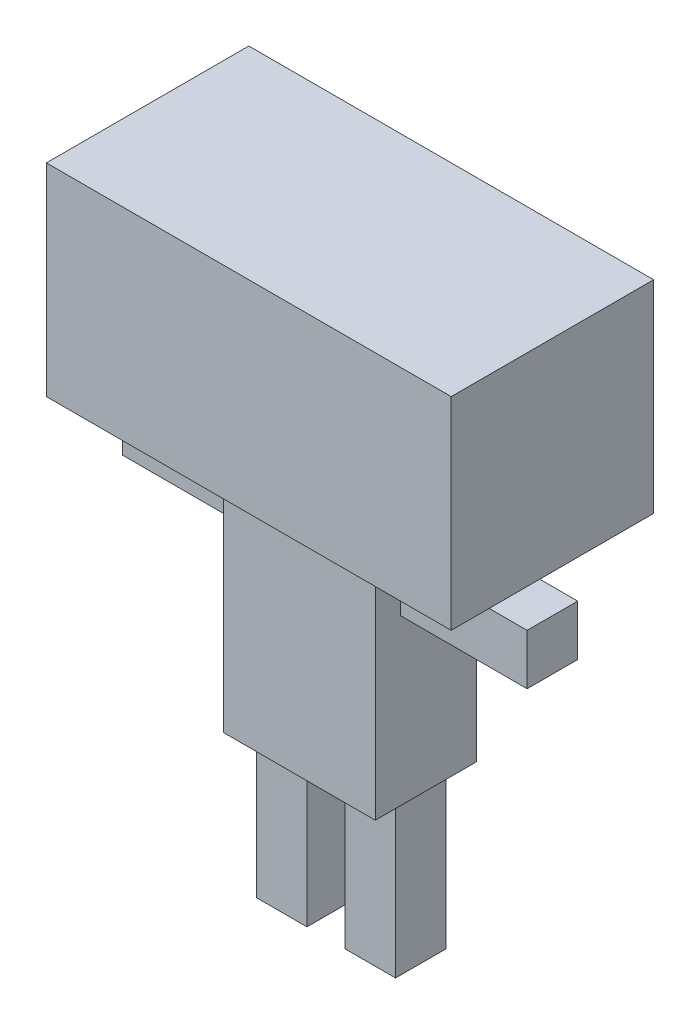
ISO-10303-21;
HEADER;
FILE_DESCRIPTION(('STEP AP214'),'2;1');
FILE_NAME('part.step','',(''),(''),'','','');
FILE_SCHEMA(('AUTOMOTIVE_DESIGN { 1 0 10303 214 1 1 1 1 }'));
ENDSEC;
DATA;
#1=APPLICATION_CONTEXT('core data for automotive mechanical design processes');
#2=APPLICATION_PROTOCOL_DEFINITION('international standard','automotive_design',2000,#1);
#3=PRODUCT_CONTEXT('',#1,'mechanical');
#4=PRODUCT('Part','Part','',(#3));
#5=PRODUCT_RELATED_PRODUCT_CATEGORY('part','',(#4));
#6=PRODUCT_DEFINITION_FORMATION('','',#4);
#7=PRODUCT_DEFINITION_CONTEXT('part definition',#1,'design');
#8=PRODUCT_DEFINITION('design','',#6,#7);
#9=PRODUCT_DEFINITION_SHAPE('','',#8);
#10=(LENGTH_UNIT() NAMED_UNIT(*) SI_UNIT(.MILLI.,.METRE.));
#11=(NAMED_UNIT(*) PLANE_ANGLE_UNIT() SI_UNIT($,.RADIAN.));
#12=(NAMED_UNIT(*) SI_UNIT($,.STERADIAN.) SOLID_ANGLE_UNIT());
#13=UNCERTAINTY_MEASURE_WITH_UNIT(LENGTH_MEASURE(1.E-05),#10,'distance_accuracy_value','');
#14=(GEOMETRIC_REPRESENTATION_CONTEXT(3) GLOBAL_UNCERTAINTY_ASSIGNED_CONTEXT((#13)) GLOBAL_UNIT_ASSIGNED_CONTEXT((#10,
#11,#12)) REPRESENTATION_CONTEXT('',''));
#15=CARTESIAN_POINT('',(0.,0.,0.));
#16=DIRECTION('',(0.,0.,1.));
#17=DIRECTION('',(1.,0.,0.));
#18=AXIS2_PLACEMENT_3D('',#15,#16,#17);
#19=CARTESIAN_POINT('',(0.,0.,-400.));
#20=DIRECTION('',(0.,0.,1.));
#21=DIRECTION('',(1.,0.,0.));
#22=AXIS2_PLACEMENT_3D('',#19,#20,#21);
#23=PLANE('',#22);
#24=CARTESIAN_POINT('',(-300.,1000.,-400.));
#25=DIRECTION('',(0.,0.,1.));
#26=DIRECTION('',(1.,0.,0.));
#27=AXIS2_PLACEMENT_3D('',#24,#25,#26);
#28=CIRCLE('',#27,100.);
#29=CARTESIAN_POINT('',(-200.,1000.,-400.));
#30=VERTEX_POINT('',#29);
#31=EDGE_CURVE('E11',#30,#30,#28,.F.);
#32=ORIENTED_EDGE('',*,*,#31,.F.);
#33=EDGE_LOOP('',(#32));
#34=FACE_BOUND('',#33,.T.);
#35=DIRECTION('',(0.,-1.,0.));
#36=VECTOR('',#35,1.);
#37=CARTESIAN_POINT('',(-800.,1300.,-400.));
#38=LINE('',#37,#36);
#39=CARTESIAN_POINT('',(-800.,1300.,-400.));
#40=VERTEX_POINT('',#39);
#41=CARTESIAN_POINT('',(-800.,500.,-400.));
#42=VERTEX_POINT('',#41);
#43=EDGE_CURVE('E410',#40,#42,#38,.T.);
#44=ORIENTED_EDGE('',*,*,#43,.F.);
#45=DIRECTION('',(-1.,0.,0.));
#46=VECTOR('',#45,1.);
#47=CARTESIAN_POINT('',(-800.,1300.,-400.));
#48=LINE('',#47,#46);
#49=CARTESIAN_POINT('',(800.,1300.,-400.));
#50=VERTEX_POINT('',#49);
#51=EDGE_CURVE('E419',#50,#40,#48,.T.);
#52=ORIENTED_EDGE('',*,*,#51,.F.);
#53=DIRECTION('',(0.,1.,0.));
#54=VECTOR('',#53,1.);
#55=CARTESIAN_POINT('',(800.,1300.,-400.));
#56=LINE('',#55,#54);
#57=CARTESIAN_POINT('',(800.,500.,-400.));
#58=VERTEX_POINT('',#57);
#59=EDGE_CURVE('E416',#58,#50,#56,.T.);
#60=ORIENTED_EDGE('',*,*,#59,.F.);
#61=DIRECTION('',(1.,0.,0.));
#62=VECTOR('',#61,1.);
#63=CARTESIAN_POINT('',(-800.,500.,-400.));
#64=LINE('',#63,#62);
#65=EDGE_CURVE('E413',#42,#58,#64,.T.);
#66=ORIENTED_EDGE('',*,*,#65,.F.);
#67=EDGE_LOOP('',(#44,#52,#60,#66));
#68=FACE_BOUND('',#67,.T.);
#69=CARTESIAN_POINT('',(300.,1000.,-400.));
#70=DIRECTION('',(0.,0.,1.));
#71=DIRECTION('',(1.,0.,0.));
#72=AXIS2_PLACEMENT_3D('',#69,#70,#71);
#73=CIRCLE('',#72,100.);
#74=CARTESIAN_POINT('',(400.,1000.,-400.));
#75=VERTEX_POINT('',#74);
#76=EDGE_CURVE('E41',#75,#75,#73,.F.);
#77=ORIENTED_EDGE('',*,*,#76,.F.);
#78=EDGE_LOOP('',(#77));
#79=FACE_BOUND('',#78,.T.);
#80=DIRECTION('',(0.707106781186547,0.707106781186547,0.));
#81=VECTOR('',#80,1.);
#82=CARTESIAN_POINT('',(-141.42135623731,658.578643762691,-400.));
#83=LINE('',#82,#81);
#84=CARTESIAN_POINT('',(-141.42135623731,658.578643762691,-400.));
#85=VERTEX_POINT('',#84);
#86=CARTESIAN_POINT('',(-1.11022302462516E-13,800.,-400.));
#87=VERTEX_POINT('',#86);
#88=EDGE_CURVE('E229',#85,#87,#83,.T.);
#89=ORIENTED_EDGE('',*,*,#88,.F.);
#90=DIRECTION('',(-1.,0.,0.));
#91=VECTOR('',#90,1.);
#92=CARTESIAN_POINT('',(141.421356237309,658.578643762691,-400.));
#93=LINE('',#92,#91);
#94=CARTESIAN_POINT('',(141.421356237309,658.578643762691,-400.));
#95=VERTEX_POINT('',#94);
#96=EDGE_CURVE('E52',#95,#85,#93,.T.);
#97=ORIENTED_EDGE('',*,*,#96,.F.);
#98=DIRECTION('',(0.707106781186548,-0.707106781186547,0.));
#99=VECTOR('',#98,1.);
#100=CARTESIAN_POINT('',(-1.11022302462516E-13,800.,-400.));
#101=LINE('',#100,#99);
#102=EDGE_CURVE('E48',#87,#95,#101,.T.);
#103=ORIENTED_EDGE('',*,*,#102,.F.);
#104=EDGE_LOOP('',(#89,#97,#103));
#105=FACE_BOUND('',#104,.T.);
#106=ADVANCED_FACE('F33',(#34,#68,#79,#105),#23,.F.);
#107=CARTESIAN_POINT('',(-300.,500.,-200.));
#108=DIRECTION('',(-1.,0.,0.));
#109=DIRECTION('',(0.,-1.,0.));
#110=AXIS2_PLACEMENT_3D('',#107,#108,#109);
#111=PLANE('',#110);
#112=DIRECTION('',(0.,0.,1.));
#113=VECTOR('',#112,1.);
#114=CARTESIAN_POINT('',(-300.,-500.,-200.));
#115=LINE('',#114,#113);
#116=CARTESIAN_POINT('',(-300.,-500.,-200.));
#117=VERTEX_POINT('',#116);
#118=CARTESIAN_POINT('',(-300.,-500.,200.));
#119=VERTEX_POINT('',#118);
#120=EDGE_CURVE('E389',#117,#119,#115,.T.);
#121=ORIENTED_EDGE('',*,*,#120,.T.);
#122=DIRECTION('',(0.,-1.,0.));
#123=VECTOR('',#122,1.);
#124=CARTESIAN_POINT('',(-300.,500.,200.));
#125=LINE('',#124,#123);
#126=CARTESIAN_POINT('',(-300.,500.,200.));
#127=VERTEX_POINT('',#126);
#128=EDGE_CURVE('E360',#127,#119,#125,.T.);
#129=ORIENTED_EDGE('',*,*,#128,.F.);
#130=DIRECTION('',(0.,0.,1.));
#131=VECTOR('',#130,1.);
#132=CARTESIAN_POINT('',(-300.,500.,-200.));
#133=LINE('',#132,#131);
#134=CARTESIAN_POINT('',(-300.,500.,-200.));
#135=VERTEX_POINT('',#134);
#136=EDGE_CURVE('E390',#135,#127,#133,.T.);
#137=ORIENTED_EDGE('',*,*,#136,.F.);
#138=DIRECTION('',(0.,-1.,0.));
#139=VECTOR('',#138,1.);
#140=CARTESIAN_POINT('',(-300.,500.,-200.));
#141=LINE('',#140,#139);
#142=EDGE_CURVE('E378',#135,#117,#141,.T.);
#143=ORIENTED_EDGE('',*,*,#142,.T.);
#144=EDGE_LOOP('',(#121,#129,#137,#143));
#145=FACE_BOUND('',#144,.T.);
#146=DIRECTION('',(0.,0.,1.));
#147=VECTOR('',#146,1.);
#148=CARTESIAN_POINT('',(-300.,150.,-100.));
#149=LINE('',#148,#147);
#150=CARTESIAN_POINT('',(-300.,150.,-100.));
#151=VERTEX_POINT('',#150);
#152=CARTESIAN_POINT('',(-300.,150.,100.));
#153=VERTEX_POINT('',#152);
#154=EDGE_CURVE('E287',#151,#153,#149,.T.);
#155=ORIENTED_EDGE('',*,*,#154,.F.);
#156=DIRECTION('',(0.,-1.,0.));
#157=VECTOR('',#156,1.);
#158=CARTESIAN_POINT('',(-300.,350.,-100.));
#159=LINE('',#158,#157);
#160=CARTESIAN_POINT('',(-300.,350.,-100.));
#161=VERTEX_POINT('',#160);
#162=EDGE_CURVE('E273',#161,#151,#159,.T.);
#163=ORIENTED_EDGE('',*,*,#162,.F.);
#164=DIRECTION('',(0.,0.,-1.));
#165=VECTOR('',#164,1.);
#166=CARTESIAN_POINT('',(-300.,350.,-100.));
#167=LINE('',#166,#165);
#168=CARTESIAN_POINT('',(-300.,350.,100.));
#169=VERTEX_POINT('',#168);
#170=EDGE_CURVE('E278',#169,#161,#167,.T.);
#171=ORIENTED_EDGE('',*,*,#170,.F.);
#172=DIRECTION('',(0.,1.,0.));
#173=VECTOR('',#172,1.);
#174=CARTESIAN_POINT('',(-300.,350.,100.));
#175=LINE('',#174,#173);
#176=EDGE_CURVE('E289',#153,#169,#175,.T.);
#177=ORIENTED_EDGE('',*,*,#176,.F.);
#178=EDGE_LOOP('',(#155,#163,#171,#177));
#179=FACE_BOUND('',#178,.T.);
#180=ADVANCED_FACE('F435',(#145,#179),#111,.T.);
#181=CARTESIAN_POINT('',(-300.,-500.,-200.));
#182=DIRECTION('',(0.,-1.,0.));
#183=DIRECTION('',(0.,0.,-1.));
#184=AXIS2_PLACEMENT_3D('',#181,#182,#183);
#185=PLANE('',#184);
#186=DIRECTION('',(0.,0.,1.));
#187=VECTOR('',#186,1.);
#188=CARTESIAN_POINT('',(-70.,-500.,-100.));
#189=LINE('',#188,#187);
#190=CARTESIAN_POINT('',(-70.,-500.,-100.));
#191=VERTEX_POINT('',#190);
#192=CARTESIAN_POINT('',(-69.9999999999999,-500.,100.));
#193=VERTEX_POINT('',#192);
#194=EDGE_CURVE('E361',#191,#193,#189,.T.);
#195=ORIENTED_EDGE('',*,*,#194,.F.);
#196=DIRECTION('',(-1.,0.,0.));
#197=VECTOR('',#196,1.);
#198=CARTESIAN_POINT('',(-270.,-500.,-100.));
#199=LINE('',#198,#197);
#200=CARTESIAN_POINT('',(-270.,-500.,-100.));
#201=VERTEX_POINT('',#200);
#202=EDGE_CURVE('E355',#191,#201,#199,.T.);
#203=ORIENTED_EDGE('',*,*,#202,.T.);
#204=DIRECTION('',(0.,0.,1.));
#205=VECTOR('',#204,1.);
#206=CARTESIAN_POINT('',(-270.,-500.,-100.));
#207=LINE('',#206,#205);
#208=CARTESIAN_POINT('',(-270.,-500.,100.));
#209=VERTEX_POINT('',#208);
#210=EDGE_CURVE('E358',#201,#209,#207,.T.);
#211=ORIENTED_EDGE('',*,*,#210,.T.);
#212=DIRECTION('',(-1.,0.,0.));
#213=VECTOR('',#212,1.);
#214=CARTESIAN_POINT('',(-270.,-500.,100.));
#215=LINE('',#214,#213);
#216=EDGE_CURVE('E343',#193,#209,#215,.T.);
#217=ORIENTED_EDGE('',*,*,#216,.F.);
#218=EDGE_LOOP('',(#195,#203,#211,#217));
#219=FACE_BOUND('',#218,.T.);
#220=DIRECTION('',(0.,0.,1.));
#221=VECTOR('',#220,1.);
#222=CARTESIAN_POINT('',(300.,-500.,-200.));
#223=LINE('',#222,#221);
#224=CARTESIAN_POINT('',(300.,-500.,-200.));
#225=VERTEX_POINT('',#224);
#226=CARTESIAN_POINT('',(300.,-500.,200.));
#227=VERTEX_POINT('',#226);
#228=EDGE_CURVE('E396',#225,#227,#223,.T.);
#229=ORIENTED_EDGE('',*,*,#228,.T.);
#230=DIRECTION('',(1.,0.,0.));
#231=VECTOR('',#230,1.);
#232=CARTESIAN_POINT('',(-300.,-500.,200.));
#233=LINE('',#232,#231);
#234=EDGE_CURVE('E369',#119,#227,#233,.T.);
#235=ORIENTED_EDGE('',*,*,#234,.F.);
#236=ORIENTED_EDGE('',*,*,#120,.F.);
#237=DIRECTION('',(1.,0.,0.));
#238=VECTOR('',#237,1.);
#239=CARTESIAN_POINT('',(-300.,-500.,-200.));
#240=LINE('',#239,#238);
#241=EDGE_CURVE('E381',#117,#225,#240,.T.);
#242=ORIENTED_EDGE('',*,*,#241,.T.);
#243=EDGE_LOOP('',(#229,#235,#236,#242));
#244=FACE_BOUND('',#243,.T.);
#245=DIRECTION('',(0.,0.,1.));
#246=VECTOR('',#245,1.);
#247=CARTESIAN_POINT('',(280.,-500.,-100.));
#248=LINE('',#247,#246);
#249=CARTESIAN_POINT('',(280.,-500.,-100.));
#250=VERTEX_POINT('',#249);
#251=CARTESIAN_POINT('',(280.,-500.,100.));
#252=VERTEX_POINT('',#251);
#253=EDGE_CURVE('E329',#250,#252,#248,.T.);
#254=ORIENTED_EDGE('',*,*,#253,.F.);
#255=DIRECTION('',(-1.,0.,0.));
#256=VECTOR('',#255,1.);
#257=CARTESIAN_POINT('',(80.,-500.,-100.));
#258=LINE('',#257,#256);
#259=CARTESIAN_POINT('',(80.,-500.,-100.));
#260=VERTEX_POINT('',#259);
#261=EDGE_CURVE('E323',#250,#260,#258,.T.);
#262=ORIENTED_EDGE('',*,*,#261,.T.);
#263=DIRECTION('',(0.,0.,1.));
#264=VECTOR('',#263,1.);
#265=CARTESIAN_POINT('',(80.,-500.,-100.));
#266=LINE('',#265,#264);
#267=CARTESIAN_POINT('',(80.,-500.,100.));
#268=VERTEX_POINT('',#267);
#269=EDGE_CURVE('E326',#260,#268,#266,.T.);
#270=ORIENTED_EDGE('',*,*,#269,.T.);
#271=DIRECTION('',(-1.,0.,0.));
#272=VECTOR('',#271,1.);
#273=CARTESIAN_POINT('',(80.,-500.,100.));
#274=LINE('',#273,#272);
#275=EDGE_CURVE('E311',#252,#268,#274,.T.);
#276=ORIENTED_EDGE('',*,*,#275,.F.);
#277=EDGE_LOOP('',(#254,#262,#270,#276));
#278=FACE_BOUND('',#277,.T.);
#279=ADVANCED_FACE('F563',(#219,#244,#278),#185,.T.);
#280=CARTESIAN_POINT('',(-800.,500.,-400.));
#281=DIRECTION('',(0.,-1.,0.));
#282=DIRECTION('',(0.,0.,-1.));
#283=AXIS2_PLACEMENT_3D('',#280,#281,#282);
#284=PLANE('',#283);
#285=DIRECTION('',(0.,0.,1.));
#286=VECTOR('',#285,1.);
#287=CARTESIAN_POINT('',(800.,500.,-400.));
#288=LINE('',#287,#286);
#289=CARTESIAN_POINT('',(800.,500.,400.));
#290=VERTEX_POINT('',#289);
#291=EDGE_CURVE('E427',#58,#290,#288,.T.);
#292=ORIENTED_EDGE('',*,*,#291,.T.);
#293=DIRECTION('',(1.,0.,0.));
#294=VECTOR('',#293,1.);
#295=CARTESIAN_POINT('',(-800.,500.,400.));
#296=LINE('',#295,#294);
#297=CARTESIAN_POINT('',(-800.,500.,400.));
#298=VERTEX_POINT('',#297);
#299=EDGE_CURVE('E401',#298,#290,#296,.T.);
#300=ORIENTED_EDGE('',*,*,#299,.F.);
#301=DIRECTION('',(0.,0.,1.));
#302=VECTOR('',#301,1.);
#303=CARTESIAN_POINT('',(-800.,500.,-400.));
#304=LINE('',#303,#302);
#305=EDGE_CURVE('E422',#42,#298,#304,.T.);
#306=ORIENTED_EDGE('',*,*,#305,.F.);
#307=ORIENTED_EDGE('',*,*,#65,.T.);
#308=EDGE_LOOP('',(#292,#300,#306,#307));
#309=FACE_BOUND('',#308,.T.);
#310=DIRECTION('',(0.,0.,1.));
#311=VECTOR('',#310,1.);
#312=CARTESIAN_POINT('',(300.,500.,-200.));
#313=LINE('',#312,#311);
#314=CARTESIAN_POINT('',(300.,500.,-200.));
#315=VERTEX_POINT('',#314);
#316=CARTESIAN_POINT('',(300.,500.,200.));
#317=VERTEX_POINT('',#316);
#318=EDGE_CURVE('E393',#315,#317,#313,.T.);
#319=ORIENTED_EDGE('',*,*,#318,.F.);
#320=DIRECTION('',(-1.,0.,0.));
#321=VECTOR('',#320,1.);
#322=CARTESIAN_POINT('',(-300.,500.,-200.));
#323=LINE('',#322,#321);
#324=EDGE_CURVE('E387',#315,#135,#323,.T.);
#325=ORIENTED_EDGE('',*,*,#324,.T.);
#326=ORIENTED_EDGE('',*,*,#136,.T.);
#327=DIRECTION('',(-1.,0.,0.));
#328=VECTOR('',#327,1.);
#329=CARTESIAN_POINT('',(-300.,500.,200.));
#330=LINE('',#329,#328);
#331=EDGE_CURVE('E375',#317,#127,#330,.T.);
#332=ORIENTED_EDGE('',*,*,#331,.F.);
#333=EDGE_LOOP('',(#319,#325,#326,#332));
#334=FACE_BOUND('',#333,.T.);
#335=ADVANCED_FACE('F566',(#309,#334),#284,.T.);
#336=CARTESIAN_POINT('',(-800.,1300.,-400.));
#337=DIRECTION('',(-1.,0.,0.));
#338=DIRECTION('',(0.,-1.,0.));
#339=AXIS2_PLACEMENT_3D('',#336,#337,#338);
#340=PLANE('',#339);
#341=ORIENTED_EDGE('',*,*,#305,.T.);
#342=DIRECTION('',(0.,-1.,0.));
#343=VECTOR('',#342,1.);
#344=CARTESIAN_POINT('',(-800.,1300.,400.));
#345=LINE('',#344,#343);
#346=CARTESIAN_POINT('',(-800.,1300.,400.));
#347=VERTEX_POINT('',#346);
#348=EDGE_CURVE('E392',#347,#298,#345,.T.);
#349=ORIENTED_EDGE('',*,*,#348,.F.);
#350=DIRECTION('',(0.,0.,1.));
#351=VECTOR('',#350,1.);
#352=CARTESIAN_POINT('',(-800.,1300.,-400.));
#353=LINE('',#352,#351);
#354=EDGE_CURVE('E423',#40,#347,#353,.T.);
#355=ORIENTED_EDGE('',*,*,#354,.F.);
#356=ORIENTED_EDGE('',*,*,#43,.T.);
#357=EDGE_LOOP('',(#341,#349,#355,#356));
#358=FACE_BOUND('',#357,.T.);
#359=ADVANCED_FACE('F35',(#358),#340,.T.);
#360=CARTESIAN_POINT('',(-800.,1300.,-400.));
#361=DIRECTION('',(0.,1.,0.));
#362=DIRECTION('',(0.,0.,1.));
#363=AXIS2_PLACEMENT_3D('',#360,#361,#362);
#364=PLANE('',#363);
#365=ORIENTED_EDGE('',*,*,#354,.T.);
#366=DIRECTION('',(-1.,0.,0.));
#367=VECTOR('',#366,1.);
#368=CARTESIAN_POINT('',(-800.,1300.,400.));
#369=LINE('',#368,#367);
#370=CARTESIAN_POINT('',(800.,1300.,400.));
#371=VERTEX_POINT('',#370);
#372=EDGE_CURVE('E407',#371,#347,#369,.T.);
#373=ORIENTED_EDGE('',*,*,#372,.F.);
#374=DIRECTION('',(0.,0.,1.));
#375=VECTOR('',#374,1.);
#376=CARTESIAN_POINT('',(800.,1300.,-400.));
#377=LINE('',#376,#375);
#378=EDGE_CURVE('E425',#50,#371,#377,.T.);
#379=ORIENTED_EDGE('',*,*,#378,.F.);
#380=ORIENTED_EDGE('',*,*,#51,.T.);
#381=EDGE_LOOP('',(#365,#373,#379,#380));
#382=FACE_BOUND('',#381,.T.);
#383=ADVANCED_FACE('F575',(#382),#364,.T.);
#384=CARTESIAN_POINT('',(800.,1300.,-400.));
#385=DIRECTION('',(1.,0.,0.));
#386=DIRECTION('',(0.,0.,-1.));
#387=AXIS2_PLACEMENT_3D('',#384,#385,#386);
#388=PLANE('',#387);
#389=ORIENTED_EDGE('',*,*,#378,.T.);
#390=DIRECTION('',(0.,1.,0.));
#391=VECTOR('',#390,1.);
#392=CARTESIAN_POINT('',(800.,1300.,400.));
#393=LINE('',#392,#391);
#394=EDGE_CURVE('E404',#290,#371,#393,.T.);
#395=ORIENTED_EDGE('',*,*,#394,.F.);
#396=ORIENTED_EDGE('',*,*,#291,.F.);
#397=ORIENTED_EDGE('',*,*,#59,.T.);
#398=EDGE_LOOP('',(#389,#395,#396,#397));
#399=FACE_BOUND('',#398,.T.);
#400=ADVANCED_FACE('F572',(#399),#388,.T.);
#401=CARTESIAN_POINT('',(0.,0.,400.));
#402=DIRECTION('',(0.,0.,1.));
#403=DIRECTION('',(1.,0.,0.));
#404=AXIS2_PLACEMENT_3D('',#401,#402,#403);
#405=PLANE('',#404);
#406=ORIENTED_EDGE('',*,*,#348,.T.);
#407=ORIENTED_EDGE('',*,*,#299,.T.);
#408=ORIENTED_EDGE('',*,*,#394,.T.);
#409=ORIENTED_EDGE('',*,*,#372,.T.);
#410=EDGE_LOOP('',(#406,#407,#408,#409));
#411=FACE_BOUND('',#410,.T.);
#412=ADVANCED_FACE('F561',(#411),#405,.T.);
#413=CARTESIAN_POINT('',(300.,500.,-200.));
#414=DIRECTION('',(1.,0.,0.));
#415=DIRECTION('',(0.,1.,0.));
#416=AXIS2_PLACEMENT_3D('',#413,#414,#415);
#417=PLANE('',#416);
#418=DIRECTION('',(0.,-1.,0.));
#419=VECTOR('',#418,1.);
#420=CARTESIAN_POINT('',(300.,350.,-100.));
#421=LINE('',#420,#419);
#422=CARTESIAN_POINT('',(300.,350.,-100.));
#423=VERTEX_POINT('',#422);
#424=CARTESIAN_POINT('',(300.,150.,-100.));
#425=VERTEX_POINT('',#424);
#426=EDGE_CURVE('E241',#423,#425,#421,.T.);
#427=ORIENTED_EDGE('',*,*,#426,.T.);
#428=DIRECTION('',(0.,0.,1.));
#429=VECTOR('',#428,1.);
#430=CARTESIAN_POINT('',(300.,150.,-100.));
#431=LINE('',#430,#429);
#432=CARTESIAN_POINT('',(300.,150.,100.));
#433=VERTEX_POINT('',#432);
#434=EDGE_CURVE('E246',#425,#433,#431,.T.);
#435=ORIENTED_EDGE('',*,*,#434,.T.);
#436=DIRECTION('',(0.,1.,0.));
#437=VECTOR('',#436,1.);
#438=CARTESIAN_POINT('',(300.,350.,100.));
#439=LINE('',#438,#437);
#440=CARTESIAN_POINT('',(300.,350.,100.));
#441=VERTEX_POINT('',#440);
#442=EDGE_CURVE('E259',#433,#441,#439,.T.);
#443=ORIENTED_EDGE('',*,*,#442,.T.);
#444=DIRECTION('',(0.,0.,-1.));
#445=VECTOR('',#444,1.);
#446=CARTESIAN_POINT('',(300.,350.,-100.));
#447=LINE('',#446,#445);
#448=EDGE_CURVE('E257',#441,#423,#447,.T.);
#449=ORIENTED_EDGE('',*,*,#448,.T.);
#450=EDGE_LOOP('',(#427,#435,#443,#449));
#451=FACE_BOUND('',#450,.T.);
#452=ORIENTED_EDGE('',*,*,#318,.T.);
#453=DIRECTION('',(0.,1.,0.));
#454=VECTOR('',#453,1.);
#455=CARTESIAN_POINT('',(300.,500.,200.));
#456=LINE('',#455,#454);
#457=EDGE_CURVE('E372',#227,#317,#456,.T.);
#458=ORIENTED_EDGE('',*,*,#457,.F.);
#459=ORIENTED_EDGE('',*,*,#228,.F.);
#460=DIRECTION('',(0.,1.,0.));
#461=VECTOR('',#460,1.);
#462=CARTESIAN_POINT('',(300.,500.,-200.));
#463=LINE('',#462,#461);
#464=EDGE_CURVE('E384',#225,#315,#463,.T.);
#465=ORIENTED_EDGE('',*,*,#464,.T.);
#466=EDGE_LOOP('',(#452,#458,#459,#465));
#467=FACE_BOUND('',#466,.T.);
#468=ADVANCED_FACE('F557',(#451,#467),#417,.T.);
#469=CARTESIAN_POINT('',(0.,0.,-200.));
#470=DIRECTION('',(0.,0.,1.));
#471=DIRECTION('',(1.,0.,0.));
#472=AXIS2_PLACEMENT_3D('',#469,#470,#471);
#473=PLANE('',#472);
#474=ORIENTED_EDGE('',*,*,#142,.F.);
#475=ORIENTED_EDGE('',*,*,#324,.F.);
#476=ORIENTED_EDGE('',*,*,#464,.F.);
#477=ORIENTED_EDGE('',*,*,#241,.F.);
#478=EDGE_LOOP('',(#474,#475,#476,#477));
#479=FACE_BOUND('',#478,.T.);
#480=ADVANCED_FACE('F553',(#479),#473,.F.);
#481=CARTESIAN_POINT('',(0.,0.,200.));
#482=DIRECTION('',(0.,0.,1.));
#483=DIRECTION('',(1.,0.,0.));
#484=AXIS2_PLACEMENT_3D('',#481,#482,#483);
#485=PLANE('',#484);
#486=ORIENTED_EDGE('',*,*,#128,.T.);
#487=ORIENTED_EDGE('',*,*,#234,.T.);
#488=ORIENTED_EDGE('',*,*,#457,.T.);
#489=ORIENTED_EDGE('',*,*,#331,.T.);
#490=EDGE_LOOP('',(#486,#487,#488,#489));
#491=FACE_BOUND('',#490,.T.);
#492=ADVANCED_FACE('F549',(#491),#485,.T.);
#493=CARTESIAN_POINT('',(-270.,-500.,-100.));
#494=DIRECTION('',(-1.,0.,0.));
#495=DIRECTION('',(0.,-1.,0.));
#496=AXIS2_PLACEMENT_3D('',#493,#494,#495);
#497=PLANE('',#496);
#498=DIRECTION('',(0.,0.,1.));
#499=VECTOR('',#498,1.);
#500=CARTESIAN_POINT('',(-270.,-1100.,-100.));
#501=LINE('',#500,#499);
#502=CARTESIAN_POINT('',(-270.,-1100.,-100.));
#503=VERTEX_POINT('',#502);
#504=CARTESIAN_POINT('',(-270.,-1100.,100.));
#505=VERTEX_POINT('',#504);
#506=EDGE_CURVE('E357',#503,#505,#501,.T.);
#507=ORIENTED_EDGE('',*,*,#506,.T.);
#508=DIRECTION('',(0.,-1.,0.));
#509=VECTOR('',#508,1.);
#510=CARTESIAN_POINT('',(-270.,-500.,100.));
#511=LINE('',#510,#509);
#512=EDGE_CURVE('E328',#209,#505,#511,.T.);
#513=ORIENTED_EDGE('',*,*,#512,.F.);
#514=ORIENTED_EDGE('',*,*,#210,.F.);
#515=DIRECTION('',(0.,-1.,0.));
#516=VECTOR('',#515,1.);
#517=CARTESIAN_POINT('',(-270.,-500.,-100.));
#518=LINE('',#517,#516);
#519=EDGE_CURVE('E346',#201,#503,#518,.T.);
#520=ORIENTED_EDGE('',*,*,#519,.T.);
#521=EDGE_LOOP('',(#507,#513,#514,#520));
#522=FACE_BOUND('',#521,.T.);
#523=ADVANCED_FACE('F542',(#522),#497,.T.);
#524=CARTESIAN_POINT('',(-70.,-500.,-100.));
#525=DIRECTION('',(1.,0.,0.));
#526=DIRECTION('',(0.,1.,0.));
#527=AXIS2_PLACEMENT_3D('',#524,#525,#526);
#528=PLANE('',#527);
#529=ORIENTED_EDGE('',*,*,#194,.T.);
#530=DIRECTION('',(0.,1.,0.));
#531=VECTOR('',#530,1.);
#532=CARTESIAN_POINT('',(-70.,-500.,100.));
#533=LINE('',#532,#531);
#534=CARTESIAN_POINT('',(-69.9999999999999,-1100.,100.));
#535=VERTEX_POINT('',#534);
#536=EDGE_CURVE('E340',#535,#193,#533,.T.);
#537=ORIENTED_EDGE('',*,*,#536,.F.);
#538=DIRECTION('',(0.,0.,1.));
#539=VECTOR('',#538,1.);
#540=CARTESIAN_POINT('',(-69.9999999999999,-1100.,-100.));
#541=LINE('',#540,#539);
#542=CARTESIAN_POINT('',(-69.9999999999999,-1100.,-100.));
#543=VERTEX_POINT('',#542);
#544=EDGE_CURVE('E364',#543,#535,#541,.T.);
#545=ORIENTED_EDGE('',*,*,#544,.F.);
#546=DIRECTION('',(0.,1.,0.));
#547=VECTOR('',#546,1.);
#548=CARTESIAN_POINT('',(-70.,-500.,-100.));
#549=LINE('',#548,#547);
#550=EDGE_CURVE('E352',#543,#191,#549,.T.);
#551=ORIENTED_EDGE('',*,*,#550,.T.);
#552=EDGE_LOOP('',(#529,#537,#545,#551));
#553=FACE_BOUND('',#552,.T.);
#554=ADVANCED_FACE('F539',(#553),#528,.T.);
#555=CARTESIAN_POINT('',(-270.,-1100.,-100.));
#556=DIRECTION('',(0.,-1.,0.));
#557=DIRECTION('',(0.,0.,-1.));
#558=AXIS2_PLACEMENT_3D('',#555,#556,#557);
#559=PLANE('',#558);
#560=ORIENTED_EDGE('',*,*,#544,.T.);
#561=DIRECTION('',(1.,0.,0.));
#562=VECTOR('',#561,1.);
#563=CARTESIAN_POINT('',(-270.,-1100.,100.));
#564=LINE('',#563,#562);
#565=EDGE_CURVE('E337',#505,#535,#564,.T.);
#566=ORIENTED_EDGE('',*,*,#565,.F.);
#567=ORIENTED_EDGE('',*,*,#506,.F.);
#568=DIRECTION('',(1.,0.,0.));
#569=VECTOR('',#568,1.);
#570=CARTESIAN_POINT('',(-270.,-1100.,-100.));
#571=LINE('',#570,#569);
#572=EDGE_CURVE('E349',#503,#543,#571,.T.);
#573=ORIENTED_EDGE('',*,*,#572,.T.);
#574=EDGE_LOOP('',(#560,#566,#567,#573));
#575=FACE_BOUND('',#574,.T.);
#576=ADVANCED_FACE('F537',(#575),#559,.T.);
#577=CARTESIAN_POINT('',(0.,0.,-100.));
#578=DIRECTION('',(0.,0.,1.));
#579=DIRECTION('',(1.,0.,0.));
#580=AXIS2_PLACEMENT_3D('',#577,#578,#579);
#581=PLANE('',#580);
#582=ORIENTED_EDGE('',*,*,#519,.F.);
#583=ORIENTED_EDGE('',*,*,#202,.F.);
#584=ORIENTED_EDGE('',*,*,#550,.F.);
#585=ORIENTED_EDGE('',*,*,#572,.F.);
#586=EDGE_LOOP('',(#582,#583,#584,#585));
#587=FACE_BOUND('',#586,.T.);
#588=ADVANCED_FACE('F533',(#587),#581,.F.);
#589=CARTESIAN_POINT('',(0.,0.,100.));
#590=DIRECTION('',(0.,0.,1.));
#591=DIRECTION('',(1.,0.,0.));
#592=AXIS2_PLACEMENT_3D('',#589,#590,#591);
#593=PLANE('',#592);
#594=ORIENTED_EDGE('',*,*,#512,.T.);
#595=ORIENTED_EDGE('',*,*,#565,.T.);
#596=ORIENTED_EDGE('',*,*,#536,.T.);
#597=ORIENTED_EDGE('',*,*,#216,.T.);
#598=EDGE_LOOP('',(#594,#595,#596,#597));
#599=FACE_BOUND('',#598,.T.);
#600=ADVANCED_FACE('F529',(#599),#593,.T.);
#601=CARTESIAN_POINT('',(80.,-500.,-100.));
#602=DIRECTION('',(-1.,0.,0.));
#603=DIRECTION('',(0.,-1.,0.));
#604=AXIS2_PLACEMENT_3D('',#601,#602,#603);
#605=PLANE('',#604);
#606=DIRECTION('',(0.,0.,1.));
#607=VECTOR('',#606,1.);
#608=CARTESIAN_POINT('',(80.0000000000001,-1100.,-100.));
#609=LINE('',#608,#607);
#610=CARTESIAN_POINT('',(80.0000000000001,-1100.,-100.));
#611=VERTEX_POINT('',#610);
#612=CARTESIAN_POINT('',(80.0000000000001,-1100.,100.));
#613=VERTEX_POINT('',#612);
#614=EDGE_CURVE('E325',#611,#613,#609,.T.);
#615=ORIENTED_EDGE('',*,*,#614,.T.);
#616=DIRECTION('',(0.,-1.,0.));
#617=VECTOR('',#616,1.);
#618=CARTESIAN_POINT('',(80.,-500.,100.));
#619=LINE('',#618,#617);
#620=EDGE_CURVE('E302',#268,#613,#619,.T.);
#621=ORIENTED_EDGE('',*,*,#620,.F.);
#622=ORIENTED_EDGE('',*,*,#269,.F.);
#623=DIRECTION('',(0.,-1.,0.));
#624=VECTOR('',#623,1.);
#625=CARTESIAN_POINT('',(80.,-500.,-100.));
#626=LINE('',#625,#624);
#627=EDGE_CURVE('E314',#260,#611,#626,.T.);
#628=ORIENTED_EDGE('',*,*,#627,.T.);
#629=EDGE_LOOP('',(#615,#621,#622,#628));
#630=FACE_BOUND('',#629,.T.);
#631=ADVANCED_FACE('F522',(#630),#605,.T.);
#632=CARTESIAN_POINT('',(280.,-500.,-100.));
#633=DIRECTION('',(1.,0.,0.));
#634=DIRECTION('',(0.,1.,0.));
#635=AXIS2_PLACEMENT_3D('',#632,#633,#634);
#636=PLANE('',#635);
#637=ORIENTED_EDGE('',*,*,#253,.T.);
#638=DIRECTION('',(0.,1.,0.));
#639=VECTOR('',#638,1.);
#640=CARTESIAN_POINT('',(280.,-500.,100.));
#641=LINE('',#640,#639);
#642=CARTESIAN_POINT('',(280.,-1100.,100.));
#643=VERTEX_POINT('',#642);
#644=EDGE_CURVE('E308',#643,#252,#641,.T.);
#645=ORIENTED_EDGE('',*,*,#644,.F.);
#646=DIRECTION('',(0.,0.,1.));
#647=VECTOR('',#646,1.);
#648=CARTESIAN_POINT('',(280.,-1100.,-100.));
#649=LINE('',#648,#647);
#650=CARTESIAN_POINT('',(280.,-1100.,-100.));
#651=VERTEX_POINT('',#650);
#652=EDGE_CURVE('E332',#651,#643,#649,.T.);
#653=ORIENTED_EDGE('',*,*,#652,.F.);
#654=DIRECTION('',(0.,1.,0.));
#655=VECTOR('',#654,1.);
#656=CARTESIAN_POINT('',(280.,-500.,-100.));
#657=LINE('',#656,#655);
#658=EDGE_CURVE('E320',#651,#250,#657,.T.);
#659=ORIENTED_EDGE('',*,*,#658,.T.);
#660=EDGE_LOOP('',(#637,#645,#653,#659));
#661=FACE_BOUND('',#660,.T.);
#662=ADVANCED_FACE('F519',(#661),#636,.T.);
#663=CARTESIAN_POINT('',(80.0000000000001,-1100.,-100.));
#664=DIRECTION('',(0.,-1.,0.));
#665=DIRECTION('',(0.,0.,-1.));
#666=AXIS2_PLACEMENT_3D('',#663,#664,#665);
#667=PLANE('',#666);
#668=ORIENTED_EDGE('',*,*,#652,.T.);
#669=DIRECTION('',(1.,0.,0.));
#670=VECTOR('',#669,1.);
#671=CARTESIAN_POINT('',(80.0000000000001,-1100.,100.));
#672=LINE('',#671,#670);
#673=EDGE_CURVE('E305',#613,#643,#672,.T.);
#674=ORIENTED_EDGE('',*,*,#673,.F.);
#675=ORIENTED_EDGE('',*,*,#614,.F.);
#676=DIRECTION('',(1.,0.,0.));
#677=VECTOR('',#676,1.);
#678=CARTESIAN_POINT('',(80.0000000000001,-1100.,-100.));
#679=LINE('',#678,#677);
#680=EDGE_CURVE('E317',#611,#651,#679,.T.);
#681=ORIENTED_EDGE('',*,*,#680,.T.);
#682=EDGE_LOOP('',(#668,#674,#675,#681));
#683=FACE_BOUND('',#682,.T.);
#684=ADVANCED_FACE('F517',(#683),#667,.T.);
#685=CARTESIAN_POINT('',(0.,0.,-100.));
#686=DIRECTION('',(0.,0.,1.));
#687=DIRECTION('',(1.,0.,0.));
#688=AXIS2_PLACEMENT_3D('',#685,#686,#687);
#689=PLANE('',#688);
#690=ORIENTED_EDGE('',*,*,#627,.F.);
#691=ORIENTED_EDGE('',*,*,#261,.F.);
#692=ORIENTED_EDGE('',*,*,#658,.F.);
#693=ORIENTED_EDGE('',*,*,#680,.F.);
#694=EDGE_LOOP('',(#690,#691,#692,#693));
#695=FACE_BOUND('',#694,.T.);
#696=ADVANCED_FACE('F513',(#695),#689,.F.);
#697=CARTESIAN_POINT('',(0.,0.,100.));
#698=DIRECTION('',(0.,0.,1.));
#699=DIRECTION('',(1.,0.,0.));
#700=AXIS2_PLACEMENT_3D('',#697,#698,#699);
#701=PLANE('',#700);
#702=ORIENTED_EDGE('',*,*,#620,.T.);
#703=ORIENTED_EDGE('',*,*,#673,.T.);
#704=ORIENTED_EDGE('',*,*,#644,.T.);
#705=ORIENTED_EDGE('',*,*,#275,.T.);
#706=EDGE_LOOP('',(#702,#703,#704,#705));
#707=FACE_BOUND('',#706,.T.);
#708=ADVANCED_FACE('F509',(#707),#701,.T.);
#709=CARTESIAN_POINT('',(-800.,350.,-100.));
#710=DIRECTION('',(0.,0.,1.));
#711=DIRECTION('',(0.,-1.,0.));
#712=AXIS2_PLACEMENT_3D('',#709,#710,#711);
#713=PLANE('',#712);
#714=ORIENTED_EDGE('',*,*,#162,.T.);
#715=DIRECTION('',(1.,0.,0.));
#716=VECTOR('',#715,1.);
#717=CARTESIAN_POINT('',(-800.,150.,-100.));
#718=LINE('',#717,#716);
#719=CARTESIAN_POINT('',(-800.,150.,-100.));
#720=VERTEX_POINT('',#719);
#721=EDGE_CURVE('E300',#720,#151,#718,.T.);
#722=ORIENTED_EDGE('',*,*,#721,.F.);
#723=DIRECTION('',(0.,-1.,0.));
#724=VECTOR('',#723,1.);
#725=CARTESIAN_POINT('',(-800.,350.,-100.));
#726=LINE('',#725,#724);
#727=CARTESIAN_POINT('',(-800.,350.,-100.));
#728=VERTEX_POINT('',#727);
#729=EDGE_CURVE('E274',#728,#720,#726,.T.);
#730=ORIENTED_EDGE('',*,*,#729,.F.);
#731=DIRECTION('',(1.,0.,0.));
#732=VECTOR('',#731,1.);
#733=CARTESIAN_POINT('',(-800.,350.,-100.));
#734=LINE('',#733,#732);
#735=EDGE_CURVE('E284',#728,#161,#734,.T.);
#736=ORIENTED_EDGE('',*,*,#735,.T.);
#737=EDGE_LOOP('',(#714,#722,#730,#736));
#738=FACE_BOUND('',#737,.T.);
#739=ADVANCED_FACE('F505',(#738),#713,.F.);
#740=CARTESIAN_POINT('',(-800.,150.,-100.));
#741=DIRECTION('',(0.,1.,0.));
#742=DIRECTION('',(-1.,0.,0.));
#743=AXIS2_PLACEMENT_3D('',#740,#741,#742);
#744=PLANE('',#743);
#745=ORIENTED_EDGE('',*,*,#154,.T.);
#746=DIRECTION('',(1.,0.,0.));
#747=VECTOR('',#746,1.);
#748=CARTESIAN_POINT('',(-800.,150.,100.));
#749=LINE('',#748,#747);
#750=CARTESIAN_POINT('',(-800.,150.,100.));
#751=VERTEX_POINT('',#750);
#752=EDGE_CURVE('E297',#751,#153,#749,.T.);
#753=ORIENTED_EDGE('',*,*,#752,.F.);
#754=DIRECTION('',(0.,0.,1.));
#755=VECTOR('',#754,1.);
#756=CARTESIAN_POINT('',(-800.,150.,-100.));
#757=LINE('',#756,#755);
#758=EDGE_CURVE('E277',#720,#751,#757,.T.);
#759=ORIENTED_EDGE('',*,*,#758,.F.);
#760=ORIENTED_EDGE('',*,*,#721,.T.);
#761=EDGE_LOOP('',(#745,#753,#759,#760));
#762=FACE_BOUND('',#761,.T.);
#763=ADVANCED_FACE('F501',(#762),#744,.F.);
#764=CARTESIAN_POINT('',(-800.,350.,100.));
#765=DIRECTION('',(0.,0.,-1.));
#766=DIRECTION('',(0.,1.,0.));
#767=AXIS2_PLACEMENT_3D('',#764,#765,#766);
#768=PLANE('',#767);
#769=ORIENTED_EDGE('',*,*,#176,.T.);
#770=DIRECTION('',(1.,0.,0.));
#771=VECTOR('',#770,1.);
#772=CARTESIAN_POINT('',(-800.,350.,100.));
#773=LINE('',#772,#771);
#774=CARTESIAN_POINT('',(-800.,350.,100.));
#775=VERTEX_POINT('',#774);
#776=EDGE_CURVE('E295',#775,#169,#773,.T.);
#777=ORIENTED_EDGE('',*,*,#776,.F.);
#778=DIRECTION('',(0.,1.,0.));
#779=VECTOR('',#778,1.);
#780=CARTESIAN_POINT('',(-800.,350.,100.));
#781=LINE('',#780,#779);
#782=EDGE_CURVE('E280',#751,#775,#781,.T.);
#783=ORIENTED_EDGE('',*,*,#782,.F.);
#784=ORIENTED_EDGE('',*,*,#752,.T.);
#785=EDGE_LOOP('',(#769,#777,#783,#784));
#786=FACE_BOUND('',#785,.T.);
#787=ADVANCED_FACE('F497',(#786),#768,.F.);
#788=CARTESIAN_POINT('',(-800.,350.,-100.));
#789=DIRECTION('',(0.,-1.,0.));
#790=DIRECTION('',(1.,0.,0.));
#791=AXIS2_PLACEMENT_3D('',#788,#789,#790);
#792=PLANE('',#791);
#793=ORIENTED_EDGE('',*,*,#170,.T.);
#794=ORIENTED_EDGE('',*,*,#735,.F.);
#795=DIRECTION('',(0.,0.,-1.));
#796=VECTOR('',#795,1.);
#797=CARTESIAN_POINT('',(-800.,350.,-100.));
#798=LINE('',#797,#796);
#799=EDGE_CURVE('E282',#775,#728,#798,.T.);
#800=ORIENTED_EDGE('',*,*,#799,.F.);
#801=ORIENTED_EDGE('',*,*,#776,.T.);
#802=EDGE_LOOP('',(#793,#794,#800,#801));
#803=FACE_BOUND('',#802,.T.);
#804=ADVANCED_FACE('F493',(#803),#792,.F.);
#805=CARTESIAN_POINT('',(-800.,-1.38777878078145E-13,0.));
#806=DIRECTION('',(-1.,0.,0.));
#807=DIRECTION('',(0.,-1.,0.));
#808=AXIS2_PLACEMENT_3D('',#805,#806,#807);
#809=PLANE('',#808);
#810=ORIENTED_EDGE('',*,*,#729,.T.);
#811=ORIENTED_EDGE('',*,*,#758,.T.);
#812=ORIENTED_EDGE('',*,*,#782,.T.);
#813=ORIENTED_EDGE('',*,*,#799,.T.);
#814=EDGE_LOOP('',(#810,#811,#812,#813));
#815=FACE_BOUND('',#814,.T.);
#816=ADVANCED_FACE('F489',(#815),#809,.T.);
#817=CARTESIAN_POINT('',(800.,350.,-100.));
#818=DIRECTION('',(0.,0.,-1.));
#819=DIRECTION('',(0.,1.,0.));
#820=AXIS2_PLACEMENT_3D('',#817,#818,#819);
#821=PLANE('',#820);
#822=ORIENTED_EDGE('',*,*,#426,.F.);
#823=DIRECTION('',(-1.,0.,0.));
#824=VECTOR('',#823,1.);
#825=CARTESIAN_POINT('',(800.,350.,-100.));
#826=LINE('',#825,#824);
#827=CARTESIAN_POINT('',(800.,350.,-100.));
#828=VERTEX_POINT('',#827);
#829=EDGE_CURVE('E270',#828,#423,#826,.T.);
#830=ORIENTED_EDGE('',*,*,#829,.F.);
#831=DIRECTION('',(0.,-1.,0.));
#832=VECTOR('',#831,1.);
#833=CARTESIAN_POINT('',(800.,350.,-100.));
#834=LINE('',#833,#832);
#835=CARTESIAN_POINT('',(800.,150.,-100.));
#836=VERTEX_POINT('',#835);
#837=EDGE_CURVE('E242',#828,#836,#834,.T.);
#838=ORIENTED_EDGE('',*,*,#837,.T.);
#839=DIRECTION('',(-1.,0.,0.));
#840=VECTOR('',#839,1.);
#841=CARTESIAN_POINT('',(800.,150.,-100.));
#842=LINE('',#841,#840);
#843=EDGE_CURVE('E255',#836,#425,#842,.T.);
#844=ORIENTED_EDGE('',*,*,#843,.T.);
#845=EDGE_LOOP('',(#822,#830,#838,#844));
#846=FACE_BOUND('',#845,.T.);
#847=ADVANCED_FACE('F485',(#846),#821,.T.);
#848=CARTESIAN_POINT('',(800.,350.,-100.));
#849=DIRECTION('',(0.,1.,0.));
#850=DIRECTION('',(-1.,0.,0.));
#851=AXIS2_PLACEMENT_3D('',#848,#849,#850);
#852=PLANE('',#851);
#853=ORIENTED_EDGE('',*,*,#448,.F.);
#854=DIRECTION('',(-1.,0.,0.));
#855=VECTOR('',#854,1.);
#856=CARTESIAN_POINT('',(800.,350.,100.));
#857=LINE('',#856,#855);
#858=CARTESIAN_POINT('',(800.,350.,100.));
#859=VERTEX_POINT('',#858);
#860=EDGE_CURVE('E267',#859,#441,#857,.T.);
#861=ORIENTED_EDGE('',*,*,#860,.F.);
#862=DIRECTION('',(0.,0.,-1.));
#863=VECTOR('',#862,1.);
#864=CARTESIAN_POINT('',(800.,350.,-100.));
#865=LINE('',#864,#863);
#866=EDGE_CURVE('E245',#859,#828,#865,.T.);
#867=ORIENTED_EDGE('',*,*,#866,.T.);
#868=ORIENTED_EDGE('',*,*,#829,.T.);
#869=EDGE_LOOP('',(#853,#861,#867,#868));
#870=FACE_BOUND('',#869,.T.);
#871=ADVANCED_FACE('F481',(#870),#852,.T.);
#872=CARTESIAN_POINT('',(800.,350.,100.));
#873=DIRECTION('',(0.,0.,1.));
#874=DIRECTION('',(0.,-1.,0.));
#875=AXIS2_PLACEMENT_3D('',#872,#873,#874);
#876=PLANE('',#875);
#877=ORIENTED_EDGE('',*,*,#442,.F.);
#878=DIRECTION('',(-1.,0.,0.));
#879=VECTOR('',#878,1.);
#880=CARTESIAN_POINT('',(800.,150.,100.));
#881=LINE('',#880,#879);
#882=CARTESIAN_POINT('',(800.,150.,100.));
#883=VERTEX_POINT('',#882);
#884=EDGE_CURVE('E264',#883,#433,#881,.T.);
#885=ORIENTED_EDGE('',*,*,#884,.F.);
#886=DIRECTION('',(0.,1.,0.));
#887=VECTOR('',#886,1.);
#888=CARTESIAN_POINT('',(800.,350.,100.));
#889=LINE('',#888,#887);
#890=EDGE_CURVE('E249',#883,#859,#889,.T.);
#891=ORIENTED_EDGE('',*,*,#890,.T.);
#892=ORIENTED_EDGE('',*,*,#860,.T.);
#893=EDGE_LOOP('',(#877,#885,#891,#892));
#894=FACE_BOUND('',#893,.T.);
#895=ADVANCED_FACE('F477',(#894),#876,.T.);
#896=CARTESIAN_POINT('',(800.,150.,-100.));
#897=DIRECTION('',(0.,-1.,0.));
#898=DIRECTION('',(1.,0.,0.));
#899=AXIS2_PLACEMENT_3D('',#896,#897,#898);
#900=PLANE('',#899);
#901=ORIENTED_EDGE('',*,*,#434,.F.);
#902=ORIENTED_EDGE('',*,*,#843,.F.);
#903=DIRECTION('',(0.,0.,1.));
#904=VECTOR('',#903,1.);
#905=CARTESIAN_POINT('',(800.,150.,-100.));
#906=LINE('',#905,#904);
#907=EDGE_CURVE('E252',#836,#883,#906,.T.);
#908=ORIENTED_EDGE('',*,*,#907,.T.);
#909=ORIENTED_EDGE('',*,*,#884,.T.);
#910=EDGE_LOOP('',(#901,#902,#908,#909));
#911=FACE_BOUND('',#910,.T.);
#912=ADVANCED_FACE('F473',(#911),#900,.T.);
#913=CARTESIAN_POINT('',(800.,-1.38777878078145E-13,0.));
#914=DIRECTION('',(1.,0.,0.));
#915=DIRECTION('',(0.,-1.,0.));
#916=AXIS2_PLACEMENT_3D('',#913,#914,#915);
#917=PLANE('',#916);
#918=ORIENTED_EDGE('',*,*,#837,.F.);
#919=ORIENTED_EDGE('',*,*,#866,.F.);
#920=ORIENTED_EDGE('',*,*,#890,.F.);
#921=ORIENTED_EDGE('',*,*,#907,.F.);
#922=EDGE_LOOP('',(#918,#919,#920,#921));
#923=FACE_BOUND('',#922,.T.);
#924=ADVANCED_FACE('F469',(#923),#917,.T.);
#925=CARTESIAN_POINT('',(300.,1000.,-500.));
#926=DIRECTION('',(0.,0.,1.));
#927=DIRECTION('',(1.,0.,0.));
#928=AXIS2_PLACEMENT_3D('',#925,#926,#927);
#929=CYLINDRICAL_SURFACE('',#928,100.);
#930=CARTESIAN_POINT('',(300.,1000.,-500.));
#931=DIRECTION('',(0.,0.,-1.));
#932=DIRECTION('',(-1.,0.,0.));
#933=AXIS2_PLACEMENT_3D('',#930,#931,#932);
#934=CIRCLE('',#933,100.);
#935=CARTESIAN_POINT('',(200.,1000.,-500.));
#936=VERTEX_POINT('',#935);
#937=EDGE_CURVE('E233',#936,#936,#934,.T.);
#938=ORIENTED_EDGE('',*,*,#937,.F.);
#939=EDGE_LOOP('',(#938));
#940=FACE_BOUND('',#939,.T.);
#941=ORIENTED_EDGE('',*,*,#76,.T.);
#942=EDGE_LOOP('',(#941));
#943=FACE_BOUND('',#942,.T.);
#944=ADVANCED_FACE('F432',(#940,#943),#929,.T.);
#945=CARTESIAN_POINT('',(300.,1000.,-500.));
#946=DIRECTION('',(0.,0.,-1.));
#947=DIRECTION('',(-1.,0.,0.));
#948=AXIS2_PLACEMENT_3D('',#945,#946,#947);
#949=PLANE('',#948);
#950=ORIENTED_EDGE('',*,*,#937,.T.);
#951=EDGE_LOOP('',(#950));
#952=FACE_BOUND('',#951,.T.);
#953=ADVANCED_FACE('F462',(#952),#949,.T.);
#954=CARTESIAN_POINT('',(-300.,1000.,-500.));
#955=DIRECTION('',(0.,0.,1.));
#956=DIRECTION('',(1.,0.,0.));
#957=AXIS2_PLACEMENT_3D('',#954,#955,#956);
#958=CYLINDRICAL_SURFACE('',#957,100.);
#959=CARTESIAN_POINT('',(-300.,1000.,-500.));
#960=DIRECTION('',(0.,0.,-1.));
#961=DIRECTION('',(-1.,0.,0.));
#962=AXIS2_PLACEMENT_3D('',#959,#960,#961);
#963=CIRCLE('',#962,100.);
#964=CARTESIAN_POINT('',(-400.,1000.,-500.));
#965=VERTEX_POINT('',#964);
#966=EDGE_CURVE('E230',#965,#965,#963,.T.);
#967=ORIENTED_EDGE('',*,*,#966,.F.);
#968=EDGE_LOOP('',(#967));
#969=FACE_BOUND('',#968,.T.);
#970=ORIENTED_EDGE('',*,*,#31,.T.);
#971=EDGE_LOOP('',(#970));
#972=FACE_BOUND('',#971,.T.);
#973=ADVANCED_FACE('F458',(#969,#972),#958,.T.);
#974=CARTESIAN_POINT('',(-300.,1000.,-500.));
#975=DIRECTION('',(0.,0.,-1.));
#976=DIRECTION('',(-1.,0.,0.));
#977=AXIS2_PLACEMENT_3D('',#974,#975,#976);
#978=PLANE('',#977);
#979=ORIENTED_EDGE('',*,*,#966,.T.);
#980=EDGE_LOOP('',(#979));
#981=FACE_BOUND('',#980,.T.);
#982=ADVANCED_FACE('F455',(#981),#978,.T.);
#983=CARTESIAN_POINT('',(-141.42135623731,658.578643762691,-500.));
#984=DIRECTION('',(0.707106781186547,-0.707106781186547,0.));
#985=DIRECTION('',(0.707106781186548,0.707106781186548,0.));
#986=AXIS2_PLACEMENT_3D('',#983,#984,#985);
#987=PLANE('',#986);
#988=ORIENTED_EDGE('',*,*,#88,.T.);
#989=DIRECTION('',(0.,0.,1.));
#990=VECTOR('',#989,1.);
#991=CARTESIAN_POINT('',(-1.11022302462516E-13,800.,-500.));
#992=LINE('',#991,#990);
#993=CARTESIAN_POINT('',(-1.11022302462516E-13,800.,-500.));
#994=VERTEX_POINT('',#993);
#995=EDGE_CURVE('E213',#994,#87,#992,.T.);
#996=ORIENTED_EDGE('',*,*,#995,.F.);
#997=DIRECTION('',(0.707106781186547,0.707106781186547,0.));
#998=VECTOR('',#997,1.);
#999=CARTESIAN_POINT('',(-141.42135623731,658.578643762691,-500.));
#1000=LINE('',#999,#998);
#1001=CARTESIAN_POINT('',(-141.42135623731,658.578643762691,-500.));
#1002=VERTEX_POINT('',#1001);
#1003=EDGE_CURVE('E220',#1002,#994,#1000,.T.);
#1004=ORIENTED_EDGE('',*,*,#1003,.F.);
#1005=DIRECTION('',(0.,0.,1.));
#1006=VECTOR('',#1005,1.);
#1007=CARTESIAN_POINT('',(-141.42135623731,658.578643762691,-500.));
#1008=LINE('',#1007,#1006);
#1009=EDGE_CURVE('E235',#1002,#85,#1008,.T.);
#1010=ORIENTED_EDGE('',*,*,#1009,.T.);
#1011=EDGE_LOOP('',(#988,#996,#1004,#1010));
#1012=FACE_BOUND('',#1011,.T.);
#1013=ADVANCED_FACE('F228',(#1012),#987,.F.);
#1014=CARTESIAN_POINT('',(-1.11022302462516E-13,800.,-500.));
#1015=DIRECTION('',(-0.707106781186547,-0.707106781186548,0.));
#1016=DIRECTION('',(0.707106781186548,-0.707106781186547,0.));
#1017=AXIS2_PLACEMENT_3D('',#1014,#1015,#1016);
#1018=PLANE('',#1017);
#1019=ORIENTED_EDGE('',*,*,#102,.T.);
#1020=DIRECTION('',(0.,0.,1.));
#1021=VECTOR('',#1020,1.);
#1022=CARTESIAN_POINT('',(141.421356237309,658.578643762691,-500.));
#1023=LINE('',#1022,#1021);
#1024=CARTESIAN_POINT('',(141.421356237309,658.578643762691,-500.));
#1025=VERTEX_POINT('',#1024);
#1026=EDGE_CURVE('E216',#1025,#95,#1023,.T.);
#1027=ORIENTED_EDGE('',*,*,#1026,.F.);
#1028=DIRECTION('',(0.707106781186548,-0.707106781186547,0.));
#1029=VECTOR('',#1028,1.);
#1030=CARTESIAN_POINT('',(-1.11022302462516E-13,800.,-500.));
#1031=LINE('',#1030,#1029);
#1032=EDGE_CURVE('E209',#994,#1025,#1031,.T.);
#1033=ORIENTED_EDGE('',*,*,#1032,.F.);
#1034=ORIENTED_EDGE('',*,*,#995,.T.);
#1035=EDGE_LOOP('',(#1019,#1027,#1033,#1034));
#1036=FACE_BOUND('',#1035,.T.);
#1037=ADVANCED_FACE('F211',(#1036),#1018,.F.);
#1038=CARTESIAN_POINT('',(141.421356237309,658.578643762691,-500.));
#1039=DIRECTION('',(0.,1.,0.));
#1040=DIRECTION('',(0.,0.,1.));
#1041=AXIS2_PLACEMENT_3D('',#1038,#1039,#1040);
#1042=PLANE('',#1041);
#1043=ORIENTED_EDGE('',*,*,#96,.T.);
#1044=ORIENTED_EDGE('',*,*,#1009,.F.);
#1045=DIRECTION('',(-1.,0.,0.));
#1046=VECTOR('',#1045,1.);
#1047=CARTESIAN_POINT('',(141.421356237309,658.578643762691,-500.));
#1048=LINE('',#1047,#1046);
#1049=EDGE_CURVE('E219',#1025,#1002,#1048,.T.);
#1050=ORIENTED_EDGE('',*,*,#1049,.F.);
#1051=ORIENTED_EDGE('',*,*,#1026,.T.);
#1052=EDGE_LOOP('',(#1043,#1044,#1050,#1051));
#1053=FACE_BOUND('',#1052,.T.);
#1054=ADVANCED_FACE('F440',(#1053),#1042,.F.);
#1055=CARTESIAN_POINT('',(0.,0.,-500.));
#1056=DIRECTION('',(0.,0.,-1.));
#1057=DIRECTION('',(-1.,0.,0.));
#1058=AXIS2_PLACEMENT_3D('',#1055,#1056,#1057);
#1059=PLANE('',#1058);
#1060=ORIENTED_EDGE('',*,*,#1003,.T.);
#1061=ORIENTED_EDGE('',*,*,#1032,.T.);
#1062=ORIENTED_EDGE('',*,*,#1049,.T.);
#1063=EDGE_LOOP('',(#1060,#1061,#1062));
#1064=FACE_BOUND('',#1063,.T.);
#1065=ADVANCED_FACE('F223',(#1064),#1059,.T.);
#1066=CLOSED_SHELL('',(#106,#180,#279,#335,#359,#383,#400,#412,#468,#480,#492,#523,#554,#576,
#588,#600,#631,#662,#684,#696,#708,#739,#763,#787,#804,#816,#847,#871,#895,#912,#924,#944,#953,
#973,#982,#1013,#1037,#1054,#1065));
#1067=MANIFOLD_SOLID_BREP('B2',#1066);
#1068=ADVANCED_BREP_SHAPE_REPRESENTATION('',(#18,#1067),#14);
#1069=SHAPE_DEFINITION_REPRESENTATION(#9,#1068);
ENDSEC;
END-ISO-10303-21;
